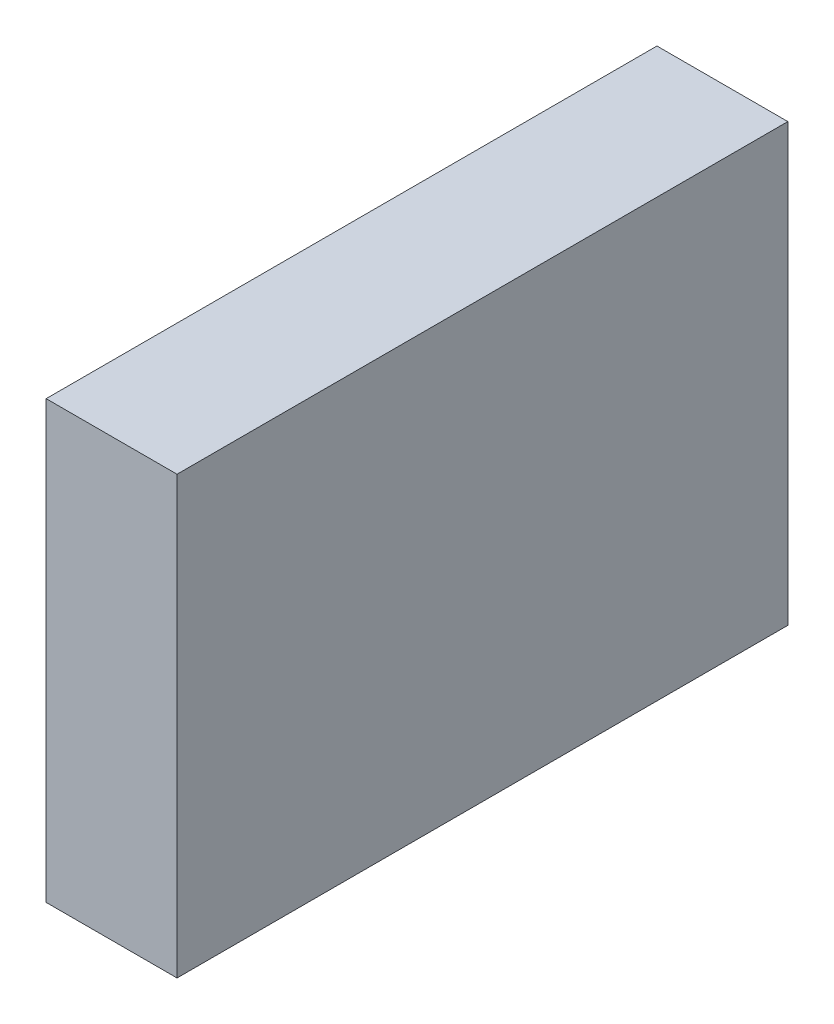
ISO-10303-21;
HEADER;
FILE_DESCRIPTION(('STEP AP214'),'2;1');
FILE_NAME('part.step','',(''),(''),'','','');
FILE_SCHEMA(('AUTOMOTIVE_DESIGN { 1 0 10303 214 1 1 1 1 }'));
ENDSEC;
DATA;
#1=APPLICATION_CONTEXT('core data for automotive mechanical design processes');
#2=APPLICATION_PROTOCOL_DEFINITION('international standard','automotive_design',2000,#1);
#3=PRODUCT_CONTEXT('',#1,'mechanical');
#4=PRODUCT('Part','Part','',(#3));
#5=PRODUCT_RELATED_PRODUCT_CATEGORY('part','',(#4));
#6=PRODUCT_DEFINITION_FORMATION('','',#4);
#7=PRODUCT_DEFINITION_CONTEXT('part definition',#1,'design');
#8=PRODUCT_DEFINITION('design','',#6,#7);
#9=PRODUCT_DEFINITION_SHAPE('','',#8);
#10=(LENGTH_UNIT() NAMED_UNIT(*) SI_UNIT(.MILLI.,.METRE.));
#11=(NAMED_UNIT(*) PLANE_ANGLE_UNIT() SI_UNIT($,.RADIAN.));
#12=(NAMED_UNIT(*) SI_UNIT($,.STERADIAN.) SOLID_ANGLE_UNIT());
#13=UNCERTAINTY_MEASURE_WITH_UNIT(LENGTH_MEASURE(1.E-05),#10,'distance_accuracy_value','');
#14=(GEOMETRIC_REPRESENTATION_CONTEXT(3) GLOBAL_UNCERTAINTY_ASSIGNED_CONTEXT((#13)) GLOBAL_UNIT_ASSIGNED_CONTEXT((#10,
#11,#12)) REPRESENTATION_CONTEXT('',''));
#15=CARTESIAN_POINT('',(0.,0.,0.));
#16=DIRECTION('',(0.,0.,1.));
#17=DIRECTION('',(1.,0.,0.));
#18=AXIS2_PLACEMENT_3D('',#15,#16,#17);
#19=CARTESIAN_POINT('',(-3.89999988110506,0.680000504428421,-3.72112146154861));
#20=DIRECTION('',(1.,-1.74845553146952E-07,0.));
#21=DIRECTION('',(1.74845553146952E-07,1.,8.74227765734759E-08));
#22=AXIS2_PLACEMENT_3D('',#19,#20,#21);
#23=PLANE('',#22);
#24=DIRECTION('',(-1.74845553146599E-07,-0.999999999999981,-8.74227765732993E-08));
#25=VECTOR('',#24,1.);
#26=CARTESIAN_POINT('',(-3.89999969402034,1.75000037591794,-2.25112136800623));
#27=LINE('',#26,#25);
#28=CARTESIAN_POINT('',(-3.89999969402034,1.75000037591694,-2.25112136800623));
#29=VERTEX_POINT('',#28);
#30=CARTESIAN_POINT('',(-3.89999986886589,0.750000375915939,-2.25112145543001));
#31=VERTEX_POINT('',#30);
#32=EDGE_CURVE('E11',#29,#31,#27,.T.);
#33=ORIENTED_EDGE('',*,*,#32,.T.);
#34=DIRECTION('',(0.,8.74227765576152E-08,-0.999999999999996));
#35=VECTOR('',#34,1.);
#36=CARTESIAN_POINT('',(-3.89999986886589,0.750000375915939,-2.25112145542901));
#37=LINE('',#36,#35);
#38=CARTESIAN_POINT('',(-3.89999986886587,0.750000498308826,-3.65112145542901));
#39=VERTEX_POINT('',#38);
#40=EDGE_CURVE('E69',#31,#39,#37,.T.);
#41=ORIENTED_EDGE('',*,*,#40,.T.);
#42=DIRECTION('',(1.74845553146599E-07,0.999999999999981,8.74227765732994E-08));
#43=VECTOR('',#42,1.);
#44=CARTESIAN_POINT('',(-3.89999986886587,0.750000498307827,-3.65112145542901));
#45=LINE('',#44,#43);
#46=CARTESIAN_POINT('',(-3.89999969402031,1.75000049830983,-3.65112136800523));
#47=VERTEX_POINT('',#46);
#48=EDGE_CURVE('E55',#39,#47,#45,.T.);
#49=ORIENTED_EDGE('',*,*,#48,.T.);
#50=DIRECTION('',(0.,-8.74227764783136E-08,0.999999999999996));
#51=VECTOR('',#50,1.);
#52=CARTESIAN_POINT('',(-3.89999969402031,1.75000049830983,-3.65112136800623));
#53=LINE('',#52,#51);
#54=EDGE_CURVE('E53',#47,#29,#53,.T.);
#55=ORIENTED_EDGE('',*,*,#54,.T.);
#56=EDGE_LOOP('',(#33,#41,#49,#55));
#57=FACE_BOUND('',#56,.T.);
#58=ADVANCED_FACE('F17',(#57),#23,.T.);
#59=CARTESIAN_POINT('',(-4.19999988110505,0.680000556882087,-3.72112146154861));
#60=DIRECTION('',(1.,-1.74845553146952E-07,0.));
#61=DIRECTION('',(1.74845553146952E-07,1.,8.74227765734759E-08));
#62=AXIS2_PLACEMENT_3D('',#59,#60,#61);
#63=PLANE('',#62);
#64=DIRECTION('',(0.,-8.74227766369168E-08,0.999999999999996));
#65=VECTOR('',#64,1.);
#66=CARTESIAN_POINT('',(-4.19999969402031,1.75000055076349,-3.65112136800624));
#67=LINE('',#66,#65);
#68=CARTESIAN_POINT('',(-4.19999969402031,1.75000055076349,-3.65112136800523));
#69=VERTEX_POINT('',#68);
#70=CARTESIAN_POINT('',(-4.19999969402034,1.75000042837061,-2.25112136800623));
#71=VERTEX_POINT('',#70);
#72=EDGE_CURVE('E24',#69,#71,#67,.T.);
#73=ORIENTED_EDGE('',*,*,#72,.F.);
#74=DIRECTION('',(1.74845553146599E-07,0.999999999999981,8.74227765732994E-08));
#75=VECTOR('',#74,1.);
#76=CARTESIAN_POINT('',(-4.19999986886587,0.750000550761492,-3.65112145542901));
#77=LINE('',#76,#75);
#78=CARTESIAN_POINT('',(-4.19999986886587,0.750000550762492,-3.65112145542901));
#79=VERTEX_POINT('',#78);
#80=EDGE_CURVE('E70',#79,#69,#77,.T.);
#81=ORIENTED_EDGE('',*,*,#80,.F.);
#82=DIRECTION('',(0.,8.74227765576152E-08,-0.999999999999996));
#83=VECTOR('',#82,1.);
#84=CARTESIAN_POINT('',(-4.19999986886589,0.750000428369605,-2.25112145542901));
#85=LINE('',#84,#83);
#86=CARTESIAN_POINT('',(-4.19999986886589,0.750000428369605,-2.25112145543001));
#87=VERTEX_POINT('',#86);
#88=EDGE_CURVE('E59',#87,#79,#85,.T.);
#89=ORIENTED_EDGE('',*,*,#88,.F.);
#90=DIRECTION('',(-1.74845553146599E-07,-0.999999999999981,-8.74227765732994E-08));
#91=VECTOR('',#90,1.);
#92=CARTESIAN_POINT('',(-4.19999969402034,1.7500004283716,-2.25112136800623));
#93=LINE('',#92,#91);
#94=EDGE_CURVE('E78',#71,#87,#93,.T.);
#95=ORIENTED_EDGE('',*,*,#94,.F.);
#96=EDGE_LOOP('',(#73,#81,#89,#95));
#97=FACE_BOUND('',#96,.T.);
#98=ADVANCED_FACE('F89',(#97),#63,.F.);
#99=CARTESIAN_POINT('',(-3.89999969402034,1.75000037591794,-2.25112136800623));
#100=DIRECTION('',(0.,8.74227765734759E-08,-1.));
#101=DIRECTION('',(-1.74845553146952E-07,-1.,-8.74227765734759E-08));
#102=AXIS2_PLACEMENT_3D('',#99,#100,#101);
#103=PLANE('',#102);
#104=DIRECTION('',(-0.999999999999985,1.74845552850889E-07,0.));
#105=VECTOR('',#104,1.);
#106=CARTESIAN_POINT('',(-3.89999969402034,1.75000037591794,-2.25112136800623));
#107=LINE('',#106,#105);
#108=EDGE_CURVE('E65',#29,#71,#107,.T.);
#109=ORIENTED_EDGE('',*,*,#108,.T.);
#110=ORIENTED_EDGE('',*,*,#94,.T.);
#111=DIRECTION('',(-0.999999999999985,1.74845553220963E-07,0.));
#112=VECTOR('',#111,1.);
#113=CARTESIAN_POINT('',(-3.89999986886589,0.750000375915939,-2.25112145542901));
#114=LINE('',#113,#112);
#115=EDGE_CURVE('E66',#31,#87,#114,.T.);
#116=ORIENTED_EDGE('',*,*,#115,.F.);
#117=ORIENTED_EDGE('',*,*,#32,.F.);
#118=EDGE_LOOP('',(#109,#110,#116,#117));
#119=FACE_BOUND('',#118,.T.);
#120=ADVANCED_FACE('F63',(#119),#103,.F.);
#121=CARTESIAN_POINT('',(-3.89999986886589,0.750000375915939,-2.25112145542901));
#122=DIRECTION('',(1.74845553146952E-07,1.,8.74227765734759E-08));
#123=DIRECTION('',(0.,8.74227765734759E-08,-1.));
#124=AXIS2_PLACEMENT_3D('',#121,#122,#123);
#125=PLANE('',#124);
#126=ORIENTED_EDGE('',*,*,#115,.T.);
#127=ORIENTED_EDGE('',*,*,#88,.T.);
#128=DIRECTION('',(-0.999999999999985,1.74845553220963E-07,0.));
#129=VECTOR('',#128,1.);
#130=CARTESIAN_POINT('',(-3.89999986886587,0.750000498307826,-3.65112145542901));
#131=LINE('',#130,#129);
#132=EDGE_CURVE('E60',#39,#79,#131,.T.);
#133=ORIENTED_EDGE('',*,*,#132,.F.);
#134=ORIENTED_EDGE('',*,*,#40,.F.);
#135=EDGE_LOOP('',(#126,#127,#133,#134));
#136=FACE_BOUND('',#135,.T.);
#137=ADVANCED_FACE('F91',(#136),#125,.F.);
#138=CARTESIAN_POINT('',(-3.89999986886587,0.750000498307826,-3.65112145542901));
#139=DIRECTION('',(0.,-8.74227765734759E-08,1.));
#140=DIRECTION('',(1.74845553146952E-07,1.,8.74227765734759E-08));
#141=AXIS2_PLACEMENT_3D('',#138,#139,#140);
#142=PLANE('',#141);
#143=ORIENTED_EDGE('',*,*,#132,.T.);
#144=ORIENTED_EDGE('',*,*,#80,.T.);
#145=DIRECTION('',(-0.999999999999985,1.74845552850889E-07,0.));
#146=VECTOR('',#145,1.);
#147=CARTESIAN_POINT('',(-3.89999969402031,1.75000049830983,-3.65112136800624));
#148=LINE('',#147,#146);
#149=EDGE_CURVE('E84',#47,#69,#148,.T.);
#150=ORIENTED_EDGE('',*,*,#149,.F.);
#151=ORIENTED_EDGE('',*,*,#48,.F.);
#152=EDGE_LOOP('',(#143,#144,#150,#151));
#153=FACE_BOUND('',#152,.T.);
#154=ADVANCED_FACE('F86',(#153),#142,.F.);
#155=CARTESIAN_POINT('',(-3.89999969402031,1.75000049830983,-3.65112136800623));
#156=DIRECTION('',(-1.74845553146952E-07,-1.,-8.74227765734759E-08));
#157=DIRECTION('',(0.,-8.74227765734759E-08,1.));
#158=AXIS2_PLACEMENT_3D('',#155,#156,#157);
#159=PLANE('',#158);
#160=ORIENTED_EDGE('',*,*,#149,.T.);
#161=ORIENTED_EDGE('',*,*,#72,.T.);
#162=ORIENTED_EDGE('',*,*,#108,.F.);
#163=ORIENTED_EDGE('',*,*,#54,.F.);
#164=EDGE_LOOP('',(#160,#161,#162,#163));
#165=FACE_BOUND('',#164,.T.);
#166=ADVANCED_FACE('F68',(#165),#159,.F.);
#167=CLOSED_SHELL('',(#58,#98,#120,#137,#154,#166));
#168=MANIFOLD_SOLID_BREP('B1',#167);
#169=ADVANCED_BREP_SHAPE_REPRESENTATION('',(#18,#168),#14);
#170=SHAPE_DEFINITION_REPRESENTATION(#9,#169);
ENDSEC;
END-ISO-10303-21;
